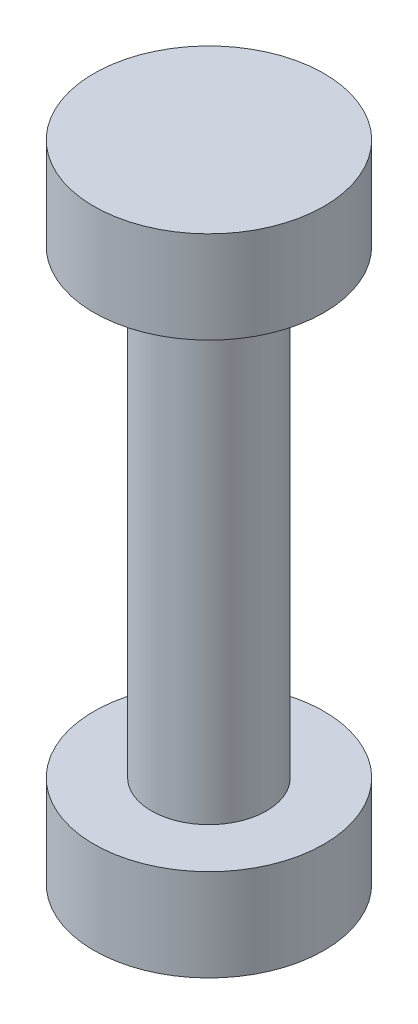
ISO-10303-21;
HEADER;
FILE_DESCRIPTION(('STEP AP214'),'2;1');
FILE_NAME('part.step','',(''),(''),'','','');
FILE_SCHEMA(('AUTOMOTIVE_DESIGN { 1 0 10303 214 1 1 1 1 }'));
ENDSEC;
DATA;
#1=APPLICATION_CONTEXT('core data for automotive mechanical design processes');
#2=APPLICATION_PROTOCOL_DEFINITION('international standard','automotive_design',2000,#1);
#3=PRODUCT_CONTEXT('',#1,'mechanical');
#4=PRODUCT('Part','Part','',(#3));
#5=PRODUCT_RELATED_PRODUCT_CATEGORY('part','',(#4));
#6=PRODUCT_DEFINITION_FORMATION('','',#4);
#7=PRODUCT_DEFINITION_CONTEXT('part definition',#1,'design');
#8=PRODUCT_DEFINITION('design','',#6,#7);
#9=PRODUCT_DEFINITION_SHAPE('','',#8);
#10=(LENGTH_UNIT() NAMED_UNIT(*) SI_UNIT(.MILLI.,.METRE.));
#11=(NAMED_UNIT(*) PLANE_ANGLE_UNIT() SI_UNIT($,.RADIAN.));
#12=(NAMED_UNIT(*) SI_UNIT($,.STERADIAN.) SOLID_ANGLE_UNIT());
#13=UNCERTAINTY_MEASURE_WITH_UNIT(LENGTH_MEASURE(1.E-05),#10,'distance_accuracy_value','');
#14=(GEOMETRIC_REPRESENTATION_CONTEXT(3) GLOBAL_UNCERTAINTY_ASSIGNED_CONTEXT((#13)) GLOBAL_UNIT_ASSIGNED_CONTEXT((#10,
#11,#12)) REPRESENTATION_CONTEXT('',''));
#15=CARTESIAN_POINT('',(0.,0.,0.));
#16=DIRECTION('',(0.,0.,1.));
#17=DIRECTION('',(1.,0.,0.));
#18=AXIS2_PLACEMENT_3D('',#15,#16,#17);
#19=CARTESIAN_POINT('',(0.,-2.,0.));
#20=DIRECTION('',(0.,1.,0.));
#21=DIRECTION('',(-1.,0.,0.));
#22=AXIS2_PLACEMENT_3D('',#19,#20,#21);
#23=CYLINDRICAL_SURFACE('',#22,2.5);
#24=CARTESIAN_POINT('',(0.,-2.,0.));
#25=DIRECTION('',(0.,-1.,0.));
#26=DIRECTION('',(1.,0.,0.));
#27=AXIS2_PLACEMENT_3D('',#24,#25,#26);
#28=CIRCLE('',#27,2.5);
#29=CARTESIAN_POINT('',(2.5,-2.,0.));
#30=VERTEX_POINT('',#29);
#31=EDGE_CURVE('E10',#30,#30,#28,.T.);
#32=ORIENTED_EDGE('',*,*,#31,.F.);
#33=EDGE_LOOP('',(#32));
#34=FACE_BOUND('',#33,.T.);
#35=CARTESIAN_POINT('',(0.,0.,0.));
#36=DIRECTION('',(0.,-1.,0.));
#37=DIRECTION('',(1.,0.,0.));
#38=AXIS2_PLACEMENT_3D('',#35,#36,#37);
#39=CIRCLE('',#38,2.5);
#40=CARTESIAN_POINT('',(2.5,0.,0.));
#41=VERTEX_POINT('',#40);
#42=EDGE_CURVE('E22',#41,#41,#39,.T.);
#43=ORIENTED_EDGE('',*,*,#42,.T.);
#44=EDGE_LOOP('',(#43));
#45=FACE_BOUND('',#44,.T.);
#46=ADVANCED_FACE('F15',(#34,#45),#23,.T.);
#47=CARTESIAN_POINT('',(0.,-2.,0.));
#48=DIRECTION('',(0.,-1.,0.));
#49=DIRECTION('',(1.,0.,0.));
#50=AXIS2_PLACEMENT_3D('',#47,#48,#49);
#51=PLANE('',#50);
#52=CARTESIAN_POINT('',(0.,-2.,0.));
#53=DIRECTION('',(0.,-1.,0.));
#54=DIRECTION('',(1.,0.,0.));
#55=AXIS2_PLACEMENT_3D('',#52,#53,#54);
#56=CIRCLE('',#55,1.25);
#57=CARTESIAN_POINT('',(1.25,-2.,0.));
#58=VERTEX_POINT('',#57);
#59=EDGE_CURVE('E29',#58,#58,#56,.T.);
#60=ORIENTED_EDGE('',*,*,#59,.F.);
#61=EDGE_LOOP('',(#60));
#62=FACE_BOUND('',#61,.T.);
#63=ORIENTED_EDGE('',*,*,#31,.T.);
#64=EDGE_LOOP('',(#63));
#65=FACE_BOUND('',#64,.T.);
#66=ADVANCED_FACE('F66',(#62,#65),#51,.T.);
#67=CARTESIAN_POINT('',(0.,0.,0.));
#68=DIRECTION('',(0.,-1.,0.));
#69=DIRECTION('',(1.,0.,0.));
#70=AXIS2_PLACEMENT_3D('',#67,#68,#69);
#71=PLANE('',#70);
#72=ORIENTED_EDGE('',*,*,#42,.F.);
#73=EDGE_LOOP('',(#72));
#74=FACE_BOUND('',#73,.T.);
#75=ADVANCED_FACE('F71',(#74),#71,.F.);
#76=CARTESIAN_POINT('',(0.,-12.,0.));
#77=DIRECTION('',(0.,1.,0.));
#78=DIRECTION('',(-1.,0.,0.));
#79=AXIS2_PLACEMENT_3D('',#76,#77,#78);
#80=CYLINDRICAL_SURFACE('',#79,1.25);
#81=CARTESIAN_POINT('',(0.,-12.,0.));
#82=DIRECTION('',(0.,-1.,0.));
#83=DIRECTION('',(1.,0.,0.));
#84=AXIS2_PLACEMENT_3D('',#81,#82,#83);
#85=CIRCLE('',#84,1.25);
#86=CARTESIAN_POINT('',(1.25,-12.,0.));
#87=VERTEX_POINT('',#86);
#88=EDGE_CURVE('E35',#87,#87,#85,.T.);
#89=ORIENTED_EDGE('',*,*,#88,.F.);
#90=EDGE_LOOP('',(#89));
#91=FACE_BOUND('',#90,.T.);
#92=ORIENTED_EDGE('',*,*,#59,.T.);
#93=EDGE_LOOP('',(#92));
#94=FACE_BOUND('',#93,.T.);
#95=ADVANCED_FACE('F76',(#91,#94),#80,.T.);
#96=CARTESIAN_POINT('',(0.,-14.,0.));
#97=DIRECTION('',(0.,1.,0.));
#98=DIRECTION('',(-1.,0.,0.));
#99=AXIS2_PLACEMENT_3D('',#96,#97,#98);
#100=CYLINDRICAL_SURFACE('',#99,2.5);
#101=CARTESIAN_POINT('',(0.,-14.,0.));
#102=DIRECTION('',(0.,-1.,0.));
#103=DIRECTION('',(1.,0.,0.));
#104=AXIS2_PLACEMENT_3D('',#101,#102,#103);
#105=CIRCLE('',#104,2.5);
#106=CARTESIAN_POINT('',(2.5,-14.,0.));
#107=VERTEX_POINT('',#106);
#108=EDGE_CURVE('E41',#107,#107,#105,.T.);
#109=ORIENTED_EDGE('',*,*,#108,.F.);
#110=EDGE_LOOP('',(#109));
#111=FACE_BOUND('',#110,.T.);
#112=CARTESIAN_POINT('',(0.,-12.,0.));
#113=DIRECTION('',(0.,-1.,0.));
#114=DIRECTION('',(1.,0.,0.));
#115=AXIS2_PLACEMENT_3D('',#112,#113,#114);
#116=CIRCLE('',#115,2.5);
#117=CARTESIAN_POINT('',(2.5,-12.,0.));
#118=VERTEX_POINT('',#117);
#119=EDGE_CURVE('E45',#118,#118,#116,.T.);
#120=ORIENTED_EDGE('',*,*,#119,.T.);
#121=EDGE_LOOP('',(#120));
#122=FACE_BOUND('',#121,.T.);
#123=ADVANCED_FACE('F52',(#111,#122),#100,.T.);
#124=CARTESIAN_POINT('',(0.,-14.,0.));
#125=DIRECTION('',(0.,-1.,0.));
#126=DIRECTION('',(1.,0.,0.));
#127=AXIS2_PLACEMENT_3D('',#124,#125,#126);
#128=PLANE('',#127);
#129=ORIENTED_EDGE('',*,*,#108,.T.);
#130=EDGE_LOOP('',(#129));
#131=FACE_BOUND('',#130,.T.);
#132=ADVANCED_FACE('F56',(#131),#128,.T.);
#133=CARTESIAN_POINT('',(0.,-12.,0.));
#134=DIRECTION('',(0.,-1.,0.));
#135=DIRECTION('',(1.,0.,0.));
#136=AXIS2_PLACEMENT_3D('',#133,#134,#135);
#137=PLANE('',#136);
#138=ORIENTED_EDGE('',*,*,#88,.T.);
#139=EDGE_LOOP('',(#138));
#140=FACE_BOUND('',#139,.T.);
#141=ORIENTED_EDGE('',*,*,#119,.F.);
#142=EDGE_LOOP('',(#141));
#143=FACE_BOUND('',#142,.T.);
#144=ADVANCED_FACE('F54',(#140,#143),#137,.F.);
#145=CLOSED_SHELL('',(#46,#66,#75,#95,#123,#132,#144));
#146=MANIFOLD_SOLID_BREP('B1',#145);
#147=ADVANCED_BREP_SHAPE_REPRESENTATION('',(#18,#146),#14);
#148=SHAPE_DEFINITION_REPRESENTATION(#9,#147);
ENDSEC;
END-ISO-10303-21;
